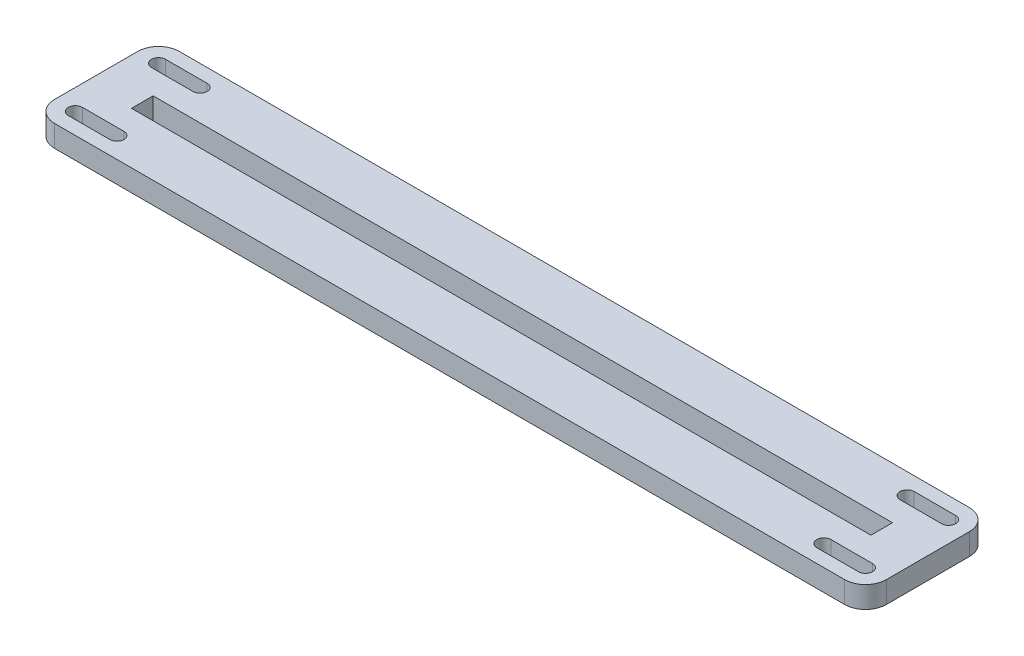
ISO-10303-21;
HEADER;
FILE_DESCRIPTION(('STEP AP214'),'2;1');
FILE_NAME('part.step','',(''),(''),'','','');
FILE_SCHEMA(('AUTOMOTIVE_DESIGN { 1 0 10303 214 1 1 1 1 }'));
ENDSEC;
DATA;
#1=APPLICATION_CONTEXT('core data for automotive mechanical design processes');
#2=APPLICATION_PROTOCOL_DEFINITION('international standard','automotive_design',2000,#1);
#3=PRODUCT_CONTEXT('',#1,'mechanical');
#4=PRODUCT('Part','Part','',(#3));
#5=PRODUCT_RELATED_PRODUCT_CATEGORY('part','',(#4));
#6=PRODUCT_DEFINITION_FORMATION('','',#4);
#7=PRODUCT_DEFINITION_CONTEXT('part definition',#1,'design');
#8=PRODUCT_DEFINITION('design','',#6,#7);
#9=PRODUCT_DEFINITION_SHAPE('','',#8);
#10=(LENGTH_UNIT() NAMED_UNIT(*) SI_UNIT(.MILLI.,.METRE.));
#11=(NAMED_UNIT(*) PLANE_ANGLE_UNIT() SI_UNIT($,.RADIAN.));
#12=(NAMED_UNIT(*) SI_UNIT($,.STERADIAN.) SOLID_ANGLE_UNIT());
#13=UNCERTAINTY_MEASURE_WITH_UNIT(LENGTH_MEASURE(1.E-05),#10,'distance_accuracy_value','');
#14=(GEOMETRIC_REPRESENTATION_CONTEXT(3) GLOBAL_UNCERTAINTY_ASSIGNED_CONTEXT((#13)) GLOBAL_UNIT_ASSIGNED_CONTEXT((#10,
#11,#12)) REPRESENTATION_CONTEXT('',''));
#15=CARTESIAN_POINT('',(0.,0.,0.));
#16=DIRECTION('',(0.,0.,1.));
#17=DIRECTION('',(1.,0.,0.));
#18=AXIS2_PLACEMENT_3D('',#15,#16,#17);
#19=CARTESIAN_POINT('',(0.,6.604,0.));
#20=DIRECTION('',(0.,1.,0.));
#21=DIRECTION('',(0.,0.,1.));
#22=AXIS2_PLACEMENT_3D('',#19,#20,#21);
#23=PLANE('',#22);
#24=DIRECTION('',(1.,0.,0.));
#25=VECTOR('',#24,1.);
#26=CARTESIAN_POINT('',(120.65,6.604,-14.859));
#27=LINE('',#26,#25);
#28=CARTESIAN_POINT('',(107.95,6.604,-14.859));
#29=VERTEX_POINT('',#28);
#30=CARTESIAN_POINT('',(120.65,6.604,-14.859));
#31=VERTEX_POINT('',#30);
#32=EDGE_CURVE('E274',#29,#31,#27,.T.);
#33=ORIENTED_EDGE('',*,*,#32,.T.);
#34=CARTESIAN_POINT('',(120.65,6.604,-12.7));
#35=DIRECTION('',(0.,-1.,0.));
#36=DIRECTION('',(0.,0.,1.));
#37=AXIS2_PLACEMENT_3D('',#34,#35,#36);
#38=CIRCLE('',#37,2.159);
#39=CARTESIAN_POINT('',(120.65,6.604,-10.541));
#40=VERTEX_POINT('',#39);
#41=EDGE_CURVE('E257',#31,#40,#38,.T.);
#42=ORIENTED_EDGE('',*,*,#41,.T.);
#43=DIRECTION('',(-1.,0.,0.));
#44=VECTOR('',#43,1.);
#45=CARTESIAN_POINT('',(120.65,6.604,-10.541));
#46=LINE('',#45,#44);
#47=CARTESIAN_POINT('',(107.95,6.604,-10.541));
#48=VERTEX_POINT('',#47);
#49=EDGE_CURVE('E264',#40,#48,#46,.T.);
#50=ORIENTED_EDGE('',*,*,#49,.T.);
#51=CARTESIAN_POINT('',(107.95,6.604,-12.7));
#52=DIRECTION('',(0.,-1.,0.));
#53=DIRECTION('',(0.,0.,1.));
#54=AXIS2_PLACEMENT_3D('',#51,#52,#53);
#55=CIRCLE('',#54,2.159);
#56=EDGE_CURVE('E277',#48,#29,#55,.T.);
#57=ORIENTED_EDGE('',*,*,#56,.T.);
#58=EDGE_LOOP('',(#33,#42,#50,#57));
#59=FACE_BOUND('',#58,.T.);
#60=CARTESIAN_POINT('',(-120.65,6.604,12.7));
#61=DIRECTION('',(0.,1.,0.));
#62=DIRECTION('',(0.,0.,1.));
#63=AXIS2_PLACEMENT_3D('',#60,#61,#62);
#64=CIRCLE('',#63,2.159);
#65=CARTESIAN_POINT('',(-120.65,6.604,10.541));
#66=VERTEX_POINT('',#65);
#67=CARTESIAN_POINT('',(-120.65,6.604,14.859));
#68=VERTEX_POINT('',#67);
#69=EDGE_CURVE('E285',#66,#68,#64,.T.);
#70=ORIENTED_EDGE('',*,*,#69,.F.);
#71=DIRECTION('',(-1.,0.,0.));
#72=VECTOR('',#71,1.);
#73=CARTESIAN_POINT('',(-120.65,6.604,10.541));
#74=LINE('',#73,#72);
#75=CARTESIAN_POINT('',(-107.95,6.604,10.541));
#76=VERTEX_POINT('',#75);
#77=EDGE_CURVE('E296',#76,#66,#74,.T.);
#78=ORIENTED_EDGE('',*,*,#77,.F.);
#79=CARTESIAN_POINT('',(-107.95,6.604,12.7));
#80=DIRECTION('',(0.,1.,0.));
#81=DIRECTION('',(0.,0.,1.));
#82=AXIS2_PLACEMENT_3D('',#79,#80,#81);
#83=CIRCLE('',#82,2.159);
#84=CARTESIAN_POINT('',(-107.95,6.604,14.859));
#85=VERTEX_POINT('',#84);
#86=EDGE_CURVE('E310',#85,#76,#83,.T.);
#87=ORIENTED_EDGE('',*,*,#86,.F.);
#88=DIRECTION('',(1.,0.,0.));
#89=VECTOR('',#88,1.);
#90=CARTESIAN_POINT('',(-120.65,6.604,14.859));
#91=LINE('',#90,#89);
#92=EDGE_CURVE('E307',#68,#85,#91,.T.);
#93=ORIENTED_EDGE('',*,*,#92,.F.);
#94=EDGE_LOOP('',(#70,#78,#87,#93));
#95=FACE_BOUND('',#94,.T.);
#96=CARTESIAN_POINT('',(-120.65,6.604,-12.7));
#97=DIRECTION('',(0.,1.,0.));
#98=DIRECTION('',(0.,0.,1.));
#99=AXIS2_PLACEMENT_3D('',#96,#97,#98);
#100=CIRCLE('',#99,2.159);
#101=CARTESIAN_POINT('',(-120.65,6.604,-14.859));
#102=VERTEX_POINT('',#101);
#103=CARTESIAN_POINT('',(-120.65,6.604,-10.541));
#104=VERTEX_POINT('',#103);
#105=EDGE_CURVE('E317',#102,#104,#100,.T.);
#106=ORIENTED_EDGE('',*,*,#105,.F.);
#107=DIRECTION('',(-1.,0.,0.));
#108=VECTOR('',#107,1.);
#109=CARTESIAN_POINT('',(-120.65,6.604,-14.859));
#110=LINE('',#109,#108);
#111=CARTESIAN_POINT('',(-107.95,6.604,-14.859));
#112=VERTEX_POINT('',#111);
#113=EDGE_CURVE('E328',#112,#102,#110,.T.);
#114=ORIENTED_EDGE('',*,*,#113,.F.);
#115=CARTESIAN_POINT('',(-107.95,6.604,-12.7));
#116=DIRECTION('',(0.,1.,0.));
#117=DIRECTION('',(0.,0.,1.));
#118=AXIS2_PLACEMENT_3D('',#115,#116,#117);
#119=CIRCLE('',#118,2.159);
#120=CARTESIAN_POINT('',(-107.95,6.604,-10.541));
#121=VERTEX_POINT('',#120);
#122=EDGE_CURVE('E342',#121,#112,#119,.T.);
#123=ORIENTED_EDGE('',*,*,#122,.F.);
#124=DIRECTION('',(1.,0.,0.));
#125=VECTOR('',#124,1.);
#126=CARTESIAN_POINT('',(-120.65,6.604,-10.541));
#127=LINE('',#126,#125);
#128=EDGE_CURVE('E339',#104,#121,#127,.T.);
#129=ORIENTED_EDGE('',*,*,#128,.F.);
#130=EDGE_LOOP('',(#106,#114,#123,#129));
#131=FACE_BOUND('',#130,.T.);
#132=DIRECTION('',(0.,0.,1.));
#133=VECTOR('',#132,1.);
#134=CARTESIAN_POINT('',(-127.,6.604,-19.05));
#135=LINE('',#134,#133);
#136=CARTESIAN_POINT('',(-127.,6.604,-12.7));
#137=VERTEX_POINT('',#136);
#138=CARTESIAN_POINT('',(-127.,6.604,12.7));
#139=VERTEX_POINT('',#138);
#140=EDGE_CURVE('E387',#137,#139,#135,.T.);
#141=ORIENTED_EDGE('',*,*,#140,.T.);
#142=CARTESIAN_POINT('',(-120.65,6.604,12.7));
#143=DIRECTION('',(0.,1.,0.));
#144=DIRECTION('',(0.,0.,1.));
#145=AXIS2_PLACEMENT_3D('',#142,#143,#144);
#146=CIRCLE('',#145,6.35);
#147=CARTESIAN_POINT('',(-120.65,6.604,19.05));
#148=VERTEX_POINT('',#147);
#149=EDGE_CURVE('E430',#139,#148,#146,.T.);
#150=ORIENTED_EDGE('',*,*,#149,.T.);
#151=DIRECTION('',(1.,0.,0.));
#152=VECTOR('',#151,1.);
#153=CARTESIAN_POINT('',(-127.,6.604,19.05));
#154=LINE('',#153,#152);
#155=CARTESIAN_POINT('',(120.65,6.604,19.05));
#156=VERTEX_POINT('',#155);
#157=EDGE_CURVE('E390',#148,#156,#154,.T.);
#158=ORIENTED_EDGE('',*,*,#157,.T.);
#159=CARTESIAN_POINT('',(120.65,6.604,12.7));
#160=DIRECTION('',(0.,1.,0.));
#161=DIRECTION('',(0.,0.,1.));
#162=AXIS2_PLACEMENT_3D('',#159,#160,#161);
#163=CIRCLE('',#162,6.35);
#164=CARTESIAN_POINT('',(127.,6.604,12.7));
#165=VERTEX_POINT('',#164);
#166=EDGE_CURVE('E428',#156,#165,#163,.T.);
#167=ORIENTED_EDGE('',*,*,#166,.T.);
#168=DIRECTION('',(0.,0.,-1.));
#169=VECTOR('',#168,1.);
#170=CARTESIAN_POINT('',(127.,6.604,-19.05));
#171=LINE('',#170,#169);
#172=CARTESIAN_POINT('',(127.,6.604,-12.7));
#173=VERTEX_POINT('',#172);
#174=EDGE_CURVE('E394',#165,#173,#171,.T.);
#175=ORIENTED_EDGE('',*,*,#174,.T.);
#176=CARTESIAN_POINT('',(120.65,6.604,-12.7));
#177=DIRECTION('',(0.,1.,0.));
#178=DIRECTION('',(0.,0.,1.));
#179=AXIS2_PLACEMENT_3D('',#176,#177,#178);
#180=CIRCLE('',#179,6.35);
#181=CARTESIAN_POINT('',(120.65,6.604,-19.05));
#182=VERTEX_POINT('',#181);
#183=EDGE_CURVE('E53',#173,#182,#180,.T.);
#184=ORIENTED_EDGE('',*,*,#183,.T.);
#185=DIRECTION('',(-1.,0.,0.));
#186=VECTOR('',#185,1.);
#187=CARTESIAN_POINT('',(-127.,6.604,-19.05));
#188=LINE('',#187,#186);
#189=CARTESIAN_POINT('',(-120.65,6.604,-19.05));
#190=VERTEX_POINT('',#189);
#191=EDGE_CURVE('E396',#182,#190,#188,.T.);
#192=ORIENTED_EDGE('',*,*,#191,.T.);
#193=CARTESIAN_POINT('',(-120.65,6.604,-12.7));
#194=DIRECTION('',(0.,1.,0.));
#195=DIRECTION('',(0.,0.,1.));
#196=AXIS2_PLACEMENT_3D('',#193,#194,#195);
#197=CIRCLE('',#196,6.35);
#198=EDGE_CURVE('E426',#190,#137,#197,.T.);
#199=ORIENTED_EDGE('',*,*,#198,.T.);
#200=EDGE_LOOP('',(#141,#150,#158,#167,#175,#184,#192,#199));
#201=FACE_BOUND('',#200,.T.);
#202=DIRECTION('',(1.,0.,0.));
#203=VECTOR('',#202,1.);
#204=CARTESIAN_POINT('',(-112.903,6.604,3.30200000000001));
#205=LINE('',#204,#203);
#206=CARTESIAN_POINT('',(-112.903,6.604,3.30200000000001));
#207=VERTEX_POINT('',#206);
#208=CARTESIAN_POINT('',(112.903,6.604,3.30200000000001));
#209=VERTEX_POINT('',#208);
#210=EDGE_CURVE('E358',#207,#209,#205,.T.);
#211=ORIENTED_EDGE('',*,*,#210,.F.);
#212=DIRECTION('',(0.,0.,1.));
#213=VECTOR('',#212,1.);
#214=CARTESIAN_POINT('',(-112.903,6.604,-3.30199999999999));
#215=LINE('',#214,#213);
#216=CARTESIAN_POINT('',(-112.903,6.604,-3.30199999999999));
#217=VERTEX_POINT('',#216);
#218=EDGE_CURVE('E356',#217,#207,#215,.T.);
#219=ORIENTED_EDGE('',*,*,#218,.F.);
#220=DIRECTION('',(-1.,0.,0.));
#221=VECTOR('',#220,1.);
#222=CARTESIAN_POINT('',(-112.903,6.604,-3.30199999999999));
#223=LINE('',#222,#221);
#224=CARTESIAN_POINT('',(112.903,6.604,-3.30199999999999));
#225=VERTEX_POINT('',#224);
#226=EDGE_CURVE('E364',#225,#217,#223,.T.);
#227=ORIENTED_EDGE('',*,*,#226,.F.);
#228=DIRECTION('',(0.,0.,-1.));
#229=VECTOR('',#228,1.);
#230=CARTESIAN_POINT('',(112.903,6.604,-3.30199999999999));
#231=LINE('',#230,#229);
#232=EDGE_CURVE('E361',#209,#225,#231,.T.);
#233=ORIENTED_EDGE('',*,*,#232,.F.);
#234=EDGE_LOOP('',(#211,#219,#227,#233));
#235=FACE_BOUND('',#234,.T.);
#236=DIRECTION('',(1.,0.,0.));
#237=VECTOR('',#236,1.);
#238=CARTESIAN_POINT('',(120.65,6.604,10.541));
#239=LINE('',#238,#237);
#240=CARTESIAN_POINT('',(107.95,6.604,10.541));
#241=VERTEX_POINT('',#240);
#242=CARTESIAN_POINT('',(120.65,6.604,10.541));
#243=VERTEX_POINT('',#242);
#244=EDGE_CURVE('E251',#241,#243,#239,.T.);
#245=ORIENTED_EDGE('',*,*,#244,.T.);
#246=CARTESIAN_POINT('',(120.65,6.604,12.7));
#247=DIRECTION('',(0.,-1.,0.));
#248=DIRECTION('',(0.,0.,1.));
#249=AXIS2_PLACEMENT_3D('',#246,#247,#248);
#250=CIRCLE('',#249,2.159);
#251=CARTESIAN_POINT('',(120.65,6.604,14.859));
#252=VERTEX_POINT('',#251);
#253=EDGE_CURVE('E237',#243,#252,#250,.T.);
#254=ORIENTED_EDGE('',*,*,#253,.T.);
#255=DIRECTION('',(-1.,0.,0.));
#256=VECTOR('',#255,1.);
#257=CARTESIAN_POINT('',(120.65,6.604,14.859));
#258=LINE('',#257,#256);
#259=CARTESIAN_POINT('',(107.95,6.604,14.859));
#260=VERTEX_POINT('',#259);
#261=EDGE_CURVE('E242',#252,#260,#258,.T.);
#262=ORIENTED_EDGE('',*,*,#261,.T.);
#263=CARTESIAN_POINT('',(107.95,6.604,12.7));
#264=DIRECTION('',(0.,-1.,0.));
#265=DIRECTION('',(0.,0.,1.));
#266=AXIS2_PLACEMENT_3D('',#263,#264,#265);
#267=CIRCLE('',#266,2.159);
#268=EDGE_CURVE('E245',#260,#241,#267,.T.);
#269=ORIENTED_EDGE('',*,*,#268,.T.);
#270=EDGE_LOOP('',(#245,#254,#262,#269));
#271=FACE_BOUND('',#270,.T.);
#272=ADVANCED_FACE('F33',(#59,#95,#131,#201,#235,#271),#23,.T.);
#273=CARTESIAN_POINT('',(0.,0.,0.));
#274=DIRECTION('',(0.,1.,0.));
#275=DIRECTION('',(0.,0.,1.));
#276=AXIS2_PLACEMENT_3D('',#273,#274,#275);
#277=PLANE('',#276);
#278=CARTESIAN_POINT('',(120.65,0.,-12.7));
#279=DIRECTION('',(0.,-1.,0.));
#280=DIRECTION('',(0.,0.,1.));
#281=AXIS2_PLACEMENT_3D('',#278,#279,#280);
#282=CIRCLE('',#281,2.159);
#283=CARTESIAN_POINT('',(120.65,0.,-14.859));
#284=VERTEX_POINT('',#283);
#285=CARTESIAN_POINT('',(120.65,0.,-10.541));
#286=VERTEX_POINT('',#285);
#287=EDGE_CURVE('E261',#284,#286,#282,.T.);
#288=ORIENTED_EDGE('',*,*,#287,.F.);
#289=DIRECTION('',(1.,0.,0.));
#290=VECTOR('',#289,1.);
#291=CARTESIAN_POINT('',(120.65,0.,-14.859));
#292=LINE('',#291,#290);
#293=CARTESIAN_POINT('',(107.95,0.,-14.859));
#294=VERTEX_POINT('',#293);
#295=EDGE_CURVE('E263',#294,#284,#292,.T.);
#296=ORIENTED_EDGE('',*,*,#295,.F.);
#297=CARTESIAN_POINT('',(107.95,0.,-12.7));
#298=DIRECTION('',(0.,-1.,0.));
#299=DIRECTION('',(0.,0.,1.));
#300=AXIS2_PLACEMENT_3D('',#297,#298,#299);
#301=CIRCLE('',#300,2.159);
#302=CARTESIAN_POINT('',(107.95,0.,-10.541));
#303=VERTEX_POINT('',#302);
#304=EDGE_CURVE('E266',#303,#294,#301,.T.);
#305=ORIENTED_EDGE('',*,*,#304,.F.);
#306=DIRECTION('',(-1.,0.,0.));
#307=VECTOR('',#306,1.);
#308=CARTESIAN_POINT('',(120.65,0.,-10.541));
#309=LINE('',#308,#307);
#310=EDGE_CURVE('E269',#286,#303,#309,.T.);
#311=ORIENTED_EDGE('',*,*,#310,.F.);
#312=EDGE_LOOP('',(#288,#296,#305,#311));
#313=FACE_BOUND('',#312,.T.);
#314=DIRECTION('',(-1.,0.,0.));
#315=VECTOR('',#314,1.);
#316=CARTESIAN_POINT('',(-120.65,0.,10.541));
#317=LINE('',#316,#315);
#318=CARTESIAN_POINT('',(-107.95,0.,10.541));
#319=VERTEX_POINT('',#318);
#320=CARTESIAN_POINT('',(-120.65,0.,10.541));
#321=VERTEX_POINT('',#320);
#322=EDGE_CURVE('E302',#319,#321,#317,.T.);
#323=ORIENTED_EDGE('',*,*,#322,.T.);
#324=CARTESIAN_POINT('',(-120.65,0.,12.7));
#325=DIRECTION('',(0.,1.,0.));
#326=DIRECTION('',(0.,0.,1.));
#327=AXIS2_PLACEMENT_3D('',#324,#325,#326);
#328=CIRCLE('',#327,2.159);
#329=CARTESIAN_POINT('',(-120.65,0.,14.859));
#330=VERTEX_POINT('',#329);
#331=EDGE_CURVE('E292',#321,#330,#328,.T.);
#332=ORIENTED_EDGE('',*,*,#331,.T.);
#333=DIRECTION('',(1.,0.,0.));
#334=VECTOR('',#333,1.);
#335=CARTESIAN_POINT('',(-120.65,0.,14.859));
#336=LINE('',#335,#334);
#337=CARTESIAN_POINT('',(-107.95,0.,14.859));
#338=VERTEX_POINT('',#337);
#339=EDGE_CURVE('E295',#330,#338,#336,.T.);
#340=ORIENTED_EDGE('',*,*,#339,.T.);
#341=CARTESIAN_POINT('',(-107.95,0.,12.7));
#342=DIRECTION('',(0.,1.,0.));
#343=DIRECTION('',(0.,0.,1.));
#344=AXIS2_PLACEMENT_3D('',#341,#342,#343);
#345=CIRCLE('',#344,2.159);
#346=EDGE_CURVE('E299',#338,#319,#345,.T.);
#347=ORIENTED_EDGE('',*,*,#346,.T.);
#348=EDGE_LOOP('',(#323,#332,#340,#347));
#349=FACE_BOUND('',#348,.T.);
#350=DIRECTION('',(-1.,0.,0.));
#351=VECTOR('',#350,1.);
#352=CARTESIAN_POINT('',(-120.65,0.,-14.859));
#353=LINE('',#352,#351);
#354=CARTESIAN_POINT('',(-107.95,0.,-14.859));
#355=VERTEX_POINT('',#354);
#356=CARTESIAN_POINT('',(-120.65,0.,-14.859));
#357=VERTEX_POINT('',#356);
#358=EDGE_CURVE('E334',#355,#357,#353,.T.);
#359=ORIENTED_EDGE('',*,*,#358,.T.);
#360=CARTESIAN_POINT('',(-120.65,0.,-12.7));
#361=DIRECTION('',(0.,1.,0.));
#362=DIRECTION('',(0.,0.,1.));
#363=AXIS2_PLACEMENT_3D('',#360,#361,#362);
#364=CIRCLE('',#363,2.159);
#365=CARTESIAN_POINT('',(-120.65,0.,-10.541));
#366=VERTEX_POINT('',#365);
#367=EDGE_CURVE('E324',#357,#366,#364,.T.);
#368=ORIENTED_EDGE('',*,*,#367,.T.);
#369=DIRECTION('',(1.,0.,0.));
#370=VECTOR('',#369,1.);
#371=CARTESIAN_POINT('',(-120.65,0.,-10.541));
#372=LINE('',#371,#370);
#373=CARTESIAN_POINT('',(-107.95,0.,-10.541));
#374=VERTEX_POINT('',#373);
#375=EDGE_CURVE('E327',#366,#374,#372,.T.);
#376=ORIENTED_EDGE('',*,*,#375,.T.);
#377=CARTESIAN_POINT('',(-107.95,0.,-12.7));
#378=DIRECTION('',(0.,1.,0.));
#379=DIRECTION('',(0.,0.,1.));
#380=AXIS2_PLACEMENT_3D('',#377,#378,#379);
#381=CIRCLE('',#380,2.159);
#382=EDGE_CURVE('E331',#374,#355,#381,.T.);
#383=ORIENTED_EDGE('',*,*,#382,.T.);
#384=EDGE_LOOP('',(#359,#368,#376,#383));
#385=FACE_BOUND('',#384,.T.);
#386=DIRECTION('',(1.,0.,0.));
#387=VECTOR('',#386,1.);
#388=CARTESIAN_POINT('',(-127.,0.,19.05));
#389=LINE('',#388,#387);
#390=CARTESIAN_POINT('',(-120.65,0.,19.05));
#391=VERTEX_POINT('',#390);
#392=CARTESIAN_POINT('',(120.65,0.,19.05));
#393=VERTEX_POINT('',#392);
#394=EDGE_CURVE('E401',#391,#393,#389,.T.);
#395=ORIENTED_EDGE('',*,*,#394,.F.);
#396=CARTESIAN_POINT('',(-120.65,0.,12.7));
#397=DIRECTION('',(0.,1.,0.));
#398=DIRECTION('',(0.,0.,1.));
#399=AXIS2_PLACEMENT_3D('',#396,#397,#398);
#400=CIRCLE('',#399,6.35);
#401=CARTESIAN_POINT('',(-127.,0.,12.7));
#402=VERTEX_POINT('',#401);
#403=EDGE_CURVE('E418',#391,#402,#400,.F.);
#404=ORIENTED_EDGE('',*,*,#403,.T.);
#405=DIRECTION('',(0.,0.,1.));
#406=VECTOR('',#405,1.);
#407=CARTESIAN_POINT('',(-127.,0.,-19.05));
#408=LINE('',#407,#406);
#409=CARTESIAN_POINT('',(-127.,0.,-12.7));
#410=VERTEX_POINT('',#409);
#411=EDGE_CURVE('E386',#410,#402,#408,.T.);
#412=ORIENTED_EDGE('',*,*,#411,.F.);
#413=CARTESIAN_POINT('',(-120.65,0.,-12.7));
#414=DIRECTION('',(0.,1.,0.));
#415=DIRECTION('',(0.,0.,1.));
#416=AXIS2_PLACEMENT_3D('',#413,#414,#415);
#417=CIRCLE('',#416,6.35);
#418=CARTESIAN_POINT('',(-120.65,0.,-19.05));
#419=VERTEX_POINT('',#418);
#420=EDGE_CURVE('E414',#410,#419,#417,.F.);
#421=ORIENTED_EDGE('',*,*,#420,.T.);
#422=DIRECTION('',(-1.,0.,0.));
#423=VECTOR('',#422,1.);
#424=CARTESIAN_POINT('',(-127.,0.,-19.05));
#425=LINE('',#424,#423);
#426=CARTESIAN_POINT('',(120.65,0.,-19.05));
#427=VERTEX_POINT('',#426);
#428=EDGE_CURVE('E391',#427,#419,#425,.T.);
#429=ORIENTED_EDGE('',*,*,#428,.F.);
#430=CARTESIAN_POINT('',(120.65,0.,-12.7));
#431=DIRECTION('',(0.,1.,0.));
#432=DIRECTION('',(0.,0.,1.));
#433=AXIS2_PLACEMENT_3D('',#430,#431,#432);
#434=CIRCLE('',#433,6.35);
#435=CARTESIAN_POINT('',(127.,0.,-12.7));
#436=VERTEX_POINT('',#435);
#437=EDGE_CURVE('E412',#427,#436,#434,.F.);
#438=ORIENTED_EDGE('',*,*,#437,.T.);
#439=DIRECTION('',(0.,0.,-1.));
#440=VECTOR('',#439,1.);
#441=CARTESIAN_POINT('',(127.,0.,-19.05));
#442=LINE('',#441,#440);
#443=CARTESIAN_POINT('',(127.,0.,12.7));
#444=VERTEX_POINT('',#443);
#445=EDGE_CURVE('E404',#444,#436,#442,.T.);
#446=ORIENTED_EDGE('',*,*,#445,.F.);
#447=CARTESIAN_POINT('',(120.65,0.,12.7));
#448=DIRECTION('',(0.,1.,0.));
#449=DIRECTION('',(0.,0.,1.));
#450=AXIS2_PLACEMENT_3D('',#447,#448,#449);
#451=CIRCLE('',#450,6.35);
#452=EDGE_CURVE('E416',#444,#393,#451,.F.);
#453=ORIENTED_EDGE('',*,*,#452,.T.);
#454=EDGE_LOOP('',(#395,#404,#412,#421,#429,#438,#446,#453));
#455=FACE_BOUND('',#454,.T.);
#456=DIRECTION('',(0.,0.,1.));
#457=VECTOR('',#456,1.);
#458=CARTESIAN_POINT('',(-112.903,0.,-3.30199999999999));
#459=LINE('',#458,#457);
#460=CARTESIAN_POINT('',(-112.903,0.,-3.30199999999999));
#461=VERTEX_POINT('',#460);
#462=CARTESIAN_POINT('',(-112.903,0.,3.30200000000001));
#463=VERTEX_POINT('',#462);
#464=EDGE_CURVE('E349',#461,#463,#459,.T.);
#465=ORIENTED_EDGE('',*,*,#464,.T.);
#466=DIRECTION('',(1.,0.,0.));
#467=VECTOR('',#466,1.);
#468=CARTESIAN_POINT('',(-112.903,0.,3.30200000000001));
#469=LINE('',#468,#467);
#470=CARTESIAN_POINT('',(112.903,0.,3.30200000000001));
#471=VERTEX_POINT('',#470);
#472=EDGE_CURVE('E369',#463,#471,#469,.T.);
#473=ORIENTED_EDGE('',*,*,#472,.T.);
#474=DIRECTION('',(0.,0.,-1.));
#475=VECTOR('',#474,1.);
#476=CARTESIAN_POINT('',(112.903,0.,-3.30199999999999));
#477=LINE('',#476,#475);
#478=CARTESIAN_POINT('',(112.903,0.,-3.30199999999999));
#479=VERTEX_POINT('',#478);
#480=EDGE_CURVE('E372',#471,#479,#477,.T.);
#481=ORIENTED_EDGE('',*,*,#480,.T.);
#482=DIRECTION('',(-1.,0.,0.));
#483=VECTOR('',#482,1.);
#484=CARTESIAN_POINT('',(-112.903,0.,-3.30199999999999));
#485=LINE('',#484,#483);
#486=EDGE_CURVE('E359',#479,#461,#485,.T.);
#487=ORIENTED_EDGE('',*,*,#486,.T.);
#488=EDGE_LOOP('',(#465,#473,#481,#487));
#489=FACE_BOUND('',#488,.T.);
#490=CARTESIAN_POINT('',(120.65,0.,12.7));
#491=DIRECTION('',(0.,-1.,0.));
#492=DIRECTION('',(0.,0.,1.));
#493=AXIS2_PLACEMENT_3D('',#490,#491,#492);
#494=CIRCLE('',#493,2.159);
#495=CARTESIAN_POINT('',(120.65,0.,10.541));
#496=VERTEX_POINT('',#495);
#497=CARTESIAN_POINT('',(120.65,0.,14.859));
#498=VERTEX_POINT('',#497);
#499=EDGE_CURVE('E230',#496,#498,#494,.T.);
#500=ORIENTED_EDGE('',*,*,#499,.F.);
#501=DIRECTION('',(1.,0.,0.));
#502=VECTOR('',#501,1.);
#503=CARTESIAN_POINT('',(120.65,0.,10.541));
#504=LINE('',#503,#502);
#505=CARTESIAN_POINT('',(107.95,0.,10.541));
#506=VERTEX_POINT('',#505);
#507=EDGE_CURVE('E218',#506,#496,#504,.T.);
#508=ORIENTED_EDGE('',*,*,#507,.F.);
#509=CARTESIAN_POINT('',(107.95,0.,12.7));
#510=DIRECTION('',(0.,-1.,0.));
#511=DIRECTION('',(0.,0.,1.));
#512=AXIS2_PLACEMENT_3D('',#509,#510,#511);
#513=CIRCLE('',#512,2.159);
#514=CARTESIAN_POINT('',(107.95,0.,14.859));
#515=VERTEX_POINT('',#514);
#516=EDGE_CURVE('E229',#515,#506,#513,.T.);
#517=ORIENTED_EDGE('',*,*,#516,.F.);
#518=DIRECTION('',(-1.,0.,0.));
#519=VECTOR('',#518,1.);
#520=CARTESIAN_POINT('',(120.65,0.,14.859));
#521=LINE('',#520,#519);
#522=EDGE_CURVE('E238',#498,#515,#521,.T.);
#523=ORIENTED_EDGE('',*,*,#522,.F.);
#524=EDGE_LOOP('',(#500,#508,#517,#523));
#525=FACE_BOUND('',#524,.T.);
#526=ADVANCED_FACE('F241',(#313,#349,#385,#455,#489,#525),#277,.F.);
#527=CARTESIAN_POINT('',(-127.,6.604,-19.05));
#528=DIRECTION('',(1.,0.,0.));
#529=DIRECTION('',(0.,0.,-1.));
#530=AXIS2_PLACEMENT_3D('',#527,#528,#529);
#531=PLANE('',#530);
#532=ORIENTED_EDGE('',*,*,#411,.T.);
#533=DIRECTION('',(0.,-1.,0.));
#534=VECTOR('',#533,1.);
#535=CARTESIAN_POINT('',(-127.,6.604,12.7));
#536=LINE('',#535,#534);
#537=EDGE_CURVE('E423',#402,#139,#536,.F.);
#538=ORIENTED_EDGE('',*,*,#537,.T.);
#539=ORIENTED_EDGE('',*,*,#140,.F.);
#540=DIRECTION('',(0.,-1.,0.));
#541=VECTOR('',#540,1.);
#542=CARTESIAN_POINT('',(-127.,6.604,-12.7));
#543=LINE('',#542,#541);
#544=EDGE_CURVE('E420',#137,#410,#543,.T.);
#545=ORIENTED_EDGE('',*,*,#544,.T.);
#546=EDGE_LOOP('',(#532,#538,#539,#545));
#547=FACE_BOUND('',#546,.T.);
#548=ADVANCED_FACE('F452',(#547),#531,.F.);
#549=CARTESIAN_POINT('',(-127.,6.604,19.05));
#550=DIRECTION('',(0.,0.,-1.));
#551=DIRECTION('',(-1.,0.,0.));
#552=AXIS2_PLACEMENT_3D('',#549,#550,#551);
#553=PLANE('',#552);
#554=ORIENTED_EDGE('',*,*,#157,.F.);
#555=DIRECTION('',(0.,-1.,0.));
#556=VECTOR('',#555,1.);
#557=CARTESIAN_POINT('',(-120.65,6.604,19.05));
#558=LINE('',#557,#556);
#559=EDGE_CURVE('E409',#148,#391,#558,.T.);
#560=ORIENTED_EDGE('',*,*,#559,.T.);
#561=ORIENTED_EDGE('',*,*,#394,.T.);
#562=DIRECTION('',(0.,-1.,0.));
#563=VECTOR('',#562,1.);
#564=CARTESIAN_POINT('',(120.65,6.604,19.05));
#565=LINE('',#564,#563);
#566=EDGE_CURVE('E398',#393,#156,#565,.F.);
#567=ORIENTED_EDGE('',*,*,#566,.T.);
#568=EDGE_LOOP('',(#554,#560,#561,#567));
#569=FACE_BOUND('',#568,.T.);
#570=ADVANCED_FACE('F461',(#569),#553,.F.);
#571=CARTESIAN_POINT('',(127.,6.604,-19.05));
#572=DIRECTION('',(-1.,0.,0.));
#573=DIRECTION('',(0.,0.,1.));
#574=AXIS2_PLACEMENT_3D('',#571,#572,#573);
#575=PLANE('',#574);
#576=ORIENTED_EDGE('',*,*,#174,.F.);
#577=DIRECTION('',(0.,-1.,0.));
#578=VECTOR('',#577,1.);
#579=CARTESIAN_POINT('',(127.,6.604,12.7));
#580=LINE('',#579,#578);
#581=EDGE_CURVE('E434',#165,#444,#580,.T.);
#582=ORIENTED_EDGE('',*,*,#581,.T.);
#583=ORIENTED_EDGE('',*,*,#445,.T.);
#584=DIRECTION('',(0.,-1.,0.));
#585=VECTOR('',#584,1.);
#586=CARTESIAN_POINT('',(127.,6.604,-12.7));
#587=LINE('',#586,#585);
#588=EDGE_CURVE('E432',#436,#173,#587,.F.);
#589=ORIENTED_EDGE('',*,*,#588,.T.);
#590=EDGE_LOOP('',(#576,#582,#583,#589));
#591=FACE_BOUND('',#590,.T.);
#592=ADVANCED_FACE('F469',(#591),#575,.F.);
#593=CARTESIAN_POINT('',(-127.,6.604,-19.05));
#594=DIRECTION('',(0.,0.,1.));
#595=DIRECTION('',(1.,0.,0.));
#596=AXIS2_PLACEMENT_3D('',#593,#594,#595);
#597=PLANE('',#596);
#598=ORIENTED_EDGE('',*,*,#428,.T.);
#599=DIRECTION('',(0.,-1.,0.));
#600=VECTOR('',#599,1.);
#601=CARTESIAN_POINT('',(-120.65,6.604,-19.05));
#602=LINE('',#601,#600);
#603=EDGE_CURVE('E11',#419,#190,#602,.F.);
#604=ORIENTED_EDGE('',*,*,#603,.T.);
#605=ORIENTED_EDGE('',*,*,#191,.F.);
#606=DIRECTION('',(0.,-1.,0.));
#607=VECTOR('',#606,1.);
#608=CARTESIAN_POINT('',(120.65,6.604,-19.05));
#609=LINE('',#608,#607);
#610=EDGE_CURVE('E41',#182,#427,#609,.T.);
#611=ORIENTED_EDGE('',*,*,#610,.T.);
#612=EDGE_LOOP('',(#598,#604,#605,#611));
#613=FACE_BOUND('',#612,.T.);
#614=ADVANCED_FACE('F439',(#613),#597,.F.);
#615=CARTESIAN_POINT('',(-112.903,6.604,-3.30199999999999));
#616=DIRECTION('',(1.,0.,0.));
#617=DIRECTION('',(0.,0.,-1.));
#618=AXIS2_PLACEMENT_3D('',#615,#616,#617);
#619=PLANE('',#618);
#620=ORIENTED_EDGE('',*,*,#464,.F.);
#621=DIRECTION('',(0.,-1.,0.));
#622=VECTOR('',#621,1.);
#623=CARTESIAN_POINT('',(-112.903,6.604,-3.30199999999999));
#624=LINE('',#623,#622);
#625=EDGE_CURVE('E366',#217,#461,#624,.T.);
#626=ORIENTED_EDGE('',*,*,#625,.F.);
#627=ORIENTED_EDGE('',*,*,#218,.T.);
#628=DIRECTION('',(0.,-1.,0.));
#629=VECTOR('',#628,1.);
#630=CARTESIAN_POINT('',(-112.903,6.604,3.30200000000001));
#631=LINE('',#630,#629);
#632=EDGE_CURVE('E383',#207,#463,#631,.T.);
#633=ORIENTED_EDGE('',*,*,#632,.T.);
#634=EDGE_LOOP('',(#620,#626,#627,#633));
#635=FACE_BOUND('',#634,.T.);
#636=ADVANCED_FACE('F485',(#635),#619,.T.);
#637=CARTESIAN_POINT('',(-112.903,6.604,3.30200000000001));
#638=DIRECTION('',(0.,0.,-1.));
#639=DIRECTION('',(-1.,0.,0.));
#640=AXIS2_PLACEMENT_3D('',#637,#638,#639);
#641=PLANE('',#640);
#642=ORIENTED_EDGE('',*,*,#472,.F.);
#643=ORIENTED_EDGE('',*,*,#632,.F.);
#644=ORIENTED_EDGE('',*,*,#210,.T.);
#645=DIRECTION('',(0.,-1.,0.));
#646=VECTOR('',#645,1.);
#647=CARTESIAN_POINT('',(112.903,6.604,3.30200000000001));
#648=LINE('',#647,#646);
#649=EDGE_CURVE('E381',#209,#471,#648,.T.);
#650=ORIENTED_EDGE('',*,*,#649,.T.);
#651=EDGE_LOOP('',(#642,#643,#644,#650));
#652=FACE_BOUND('',#651,.T.);
#653=ADVANCED_FACE('F688',(#652),#641,.T.);
#654=CARTESIAN_POINT('',(112.903,6.604,-3.30199999999999));
#655=DIRECTION('',(-1.,0.,0.));
#656=DIRECTION('',(0.,0.,1.));
#657=AXIS2_PLACEMENT_3D('',#654,#655,#656);
#658=PLANE('',#657);
#659=ORIENTED_EDGE('',*,*,#480,.F.);
#660=ORIENTED_EDGE('',*,*,#649,.F.);
#661=ORIENTED_EDGE('',*,*,#232,.T.);
#662=DIRECTION('',(0.,-1.,0.));
#663=VECTOR('',#662,1.);
#664=CARTESIAN_POINT('',(112.903,6.604,-3.30199999999999));
#665=LINE('',#664,#663);
#666=EDGE_CURVE('E379',#225,#479,#665,.T.);
#667=ORIENTED_EDGE('',*,*,#666,.T.);
#668=EDGE_LOOP('',(#659,#660,#661,#667));
#669=FACE_BOUND('',#668,.T.);
#670=ADVANCED_FACE('F679',(#669),#658,.T.);
#671=CARTESIAN_POINT('',(-112.903,6.604,-3.30199999999999));
#672=DIRECTION('',(0.,0.,1.));
#673=DIRECTION('',(1.,0.,0.));
#674=AXIS2_PLACEMENT_3D('',#671,#672,#673);
#675=PLANE('',#674);
#676=ORIENTED_EDGE('',*,*,#486,.F.);
#677=ORIENTED_EDGE('',*,*,#666,.F.);
#678=ORIENTED_EDGE('',*,*,#226,.T.);
#679=ORIENTED_EDGE('',*,*,#625,.T.);
#680=EDGE_LOOP('',(#676,#677,#678,#679));
#681=FACE_BOUND('',#680,.T.);
#682=ADVANCED_FACE('F670',(#681),#675,.T.);
#683=CARTESIAN_POINT('',(-120.65,0.,-12.7));
#684=DIRECTION('',(0.,1.,0.));
#685=DIRECTION('',(0.,0.,1.));
#686=AXIS2_PLACEMENT_3D('',#683,#684,#685);
#687=CYLINDRICAL_SURFACE('',#686,2.159);
#688=ORIENTED_EDGE('',*,*,#105,.T.);
#689=DIRECTION('',(0.,1.,0.));
#690=VECTOR('',#689,1.);
#691=CARTESIAN_POINT('',(-120.65,0.,-10.541));
#692=LINE('',#691,#690);
#693=EDGE_CURVE('E337',#366,#104,#692,.T.);
#694=ORIENTED_EDGE('',*,*,#693,.F.);
#695=ORIENTED_EDGE('',*,*,#367,.F.);
#696=DIRECTION('',(0.,1.,0.));
#697=VECTOR('',#696,1.);
#698=CARTESIAN_POINT('',(-120.65,0.,-14.859));
#699=LINE('',#698,#697);
#700=EDGE_CURVE('E347',#357,#102,#699,.T.);
#701=ORIENTED_EDGE('',*,*,#700,.T.);
#702=EDGE_LOOP('',(#688,#694,#695,#701));
#703=FACE_BOUND('',#702,.T.);
#704=ADVANCED_FACE('F661',(#703),#687,.F.);
#705=CARTESIAN_POINT('',(-120.65,0.,-14.859));
#706=DIRECTION('',(0.,0.,-1.));
#707=DIRECTION('',(-1.,0.,0.));
#708=AXIS2_PLACEMENT_3D('',#705,#706,#707);
#709=PLANE('',#708);
#710=ORIENTED_EDGE('',*,*,#113,.T.);
#711=ORIENTED_EDGE('',*,*,#700,.F.);
#712=ORIENTED_EDGE('',*,*,#358,.F.);
#713=DIRECTION('',(0.,1.,0.));
#714=VECTOR('',#713,1.);
#715=CARTESIAN_POINT('',(-107.95,0.,-14.859));
#716=LINE('',#715,#714);
#717=EDGE_CURVE('E350',#355,#112,#716,.T.);
#718=ORIENTED_EDGE('',*,*,#717,.T.);
#719=EDGE_LOOP('',(#710,#711,#712,#718));
#720=FACE_BOUND('',#719,.T.);
#721=ADVANCED_FACE('F652',(#720),#709,.F.);
#722=CARTESIAN_POINT('',(-107.95,0.,-12.7));
#723=DIRECTION('',(0.,1.,0.));
#724=DIRECTION('',(0.,0.,1.));
#725=AXIS2_PLACEMENT_3D('',#722,#723,#724);
#726=CYLINDRICAL_SURFACE('',#725,2.159);
#727=ORIENTED_EDGE('',*,*,#122,.T.);
#728=ORIENTED_EDGE('',*,*,#717,.F.);
#729=ORIENTED_EDGE('',*,*,#382,.F.);
#730=DIRECTION('',(0.,1.,0.));
#731=VECTOR('',#730,1.);
#732=CARTESIAN_POINT('',(-107.95,0.,-10.541));
#733=LINE('',#732,#731);
#734=EDGE_CURVE('E352',#374,#121,#733,.T.);
#735=ORIENTED_EDGE('',*,*,#734,.T.);
#736=EDGE_LOOP('',(#727,#728,#729,#735));
#737=FACE_BOUND('',#736,.T.);
#738=ADVANCED_FACE('F643',(#737),#726,.F.);
#739=CARTESIAN_POINT('',(-120.65,0.,-10.541));
#740=DIRECTION('',(0.,0.,1.));
#741=DIRECTION('',(1.,0.,0.));
#742=AXIS2_PLACEMENT_3D('',#739,#740,#741);
#743=PLANE('',#742);
#744=ORIENTED_EDGE('',*,*,#128,.T.);
#745=ORIENTED_EDGE('',*,*,#734,.F.);
#746=ORIENTED_EDGE('',*,*,#375,.F.);
#747=ORIENTED_EDGE('',*,*,#693,.T.);
#748=EDGE_LOOP('',(#744,#745,#746,#747));
#749=FACE_BOUND('',#748,.T.);
#750=ADVANCED_FACE('F634',(#749),#743,.F.);
#751=CARTESIAN_POINT('',(-120.65,0.,12.7));
#752=DIRECTION('',(0.,1.,0.));
#753=DIRECTION('',(0.,0.,1.));
#754=AXIS2_PLACEMENT_3D('',#751,#752,#753);
#755=CYLINDRICAL_SURFACE('',#754,2.159);
#756=ORIENTED_EDGE('',*,*,#69,.T.);
#757=DIRECTION('',(0.,1.,0.));
#758=VECTOR('',#757,1.);
#759=CARTESIAN_POINT('',(-120.65,0.,14.859));
#760=LINE('',#759,#758);
#761=EDGE_CURVE('E305',#330,#68,#760,.T.);
#762=ORIENTED_EDGE('',*,*,#761,.F.);
#763=ORIENTED_EDGE('',*,*,#331,.F.);
#764=DIRECTION('',(0.,1.,0.));
#765=VECTOR('',#764,1.);
#766=CARTESIAN_POINT('',(-120.65,0.,10.541));
#767=LINE('',#766,#765);
#768=EDGE_CURVE('E315',#321,#66,#767,.T.);
#769=ORIENTED_EDGE('',*,*,#768,.T.);
#770=EDGE_LOOP('',(#756,#762,#763,#769));
#771=FACE_BOUND('',#770,.T.);
#772=ADVANCED_FACE('F625',(#771),#755,.F.);
#773=CARTESIAN_POINT('',(-120.65,0.,10.541));
#774=DIRECTION('',(0.,0.,-1.));
#775=DIRECTION('',(-1.,0.,0.));
#776=AXIS2_PLACEMENT_3D('',#773,#774,#775);
#777=PLANE('',#776);
#778=ORIENTED_EDGE('',*,*,#77,.T.);
#779=ORIENTED_EDGE('',*,*,#768,.F.);
#780=ORIENTED_EDGE('',*,*,#322,.F.);
#781=DIRECTION('',(0.,1.,0.));
#782=VECTOR('',#781,1.);
#783=CARTESIAN_POINT('',(-107.95,0.,10.541));
#784=LINE('',#783,#782);
#785=EDGE_CURVE('E318',#319,#76,#784,.T.);
#786=ORIENTED_EDGE('',*,*,#785,.T.);
#787=EDGE_LOOP('',(#778,#779,#780,#786));
#788=FACE_BOUND('',#787,.T.);
#789=ADVANCED_FACE('F616',(#788),#777,.F.);
#790=CARTESIAN_POINT('',(-107.95,0.,12.7));
#791=DIRECTION('',(0.,1.,0.));
#792=DIRECTION('',(0.,0.,1.));
#793=AXIS2_PLACEMENT_3D('',#790,#791,#792);
#794=CYLINDRICAL_SURFACE('',#793,2.159);
#795=ORIENTED_EDGE('',*,*,#86,.T.);
#796=ORIENTED_EDGE('',*,*,#785,.F.);
#797=ORIENTED_EDGE('',*,*,#346,.F.);
#798=DIRECTION('',(0.,1.,0.));
#799=VECTOR('',#798,1.);
#800=CARTESIAN_POINT('',(-107.95,0.,14.859));
#801=LINE('',#800,#799);
#802=EDGE_CURVE('E320',#338,#85,#801,.T.);
#803=ORIENTED_EDGE('',*,*,#802,.T.);
#804=EDGE_LOOP('',(#795,#796,#797,#803));
#805=FACE_BOUND('',#804,.T.);
#806=ADVANCED_FACE('F607',(#805),#794,.F.);
#807=CARTESIAN_POINT('',(-120.65,0.,14.859));
#808=DIRECTION('',(0.,0.,1.));
#809=DIRECTION('',(1.,0.,0.));
#810=AXIS2_PLACEMENT_3D('',#807,#808,#809);
#811=PLANE('',#810);
#812=ORIENTED_EDGE('',*,*,#92,.T.);
#813=ORIENTED_EDGE('',*,*,#802,.F.);
#814=ORIENTED_EDGE('',*,*,#339,.F.);
#815=ORIENTED_EDGE('',*,*,#761,.T.);
#816=EDGE_LOOP('',(#812,#813,#814,#815));
#817=FACE_BOUND('',#816,.T.);
#818=ADVANCED_FACE('F588',(#817),#811,.F.);
#819=CARTESIAN_POINT('',(120.65,0.,-12.7));
#820=DIRECTION('',(0.,1.,0.));
#821=DIRECTION('',(0.,0.,1.));
#822=AXIS2_PLACEMENT_3D('',#819,#820,#821);
#823=CYLINDRICAL_SURFACE('',#822,2.159);
#824=ORIENTED_EDGE('',*,*,#41,.F.);
#825=DIRECTION('',(0.,1.,0.));
#826=VECTOR('',#825,1.);
#827=CARTESIAN_POINT('',(120.65,0.,-14.859));
#828=LINE('',#827,#826);
#829=EDGE_CURVE('E271',#284,#31,#828,.T.);
#830=ORIENTED_EDGE('',*,*,#829,.F.);
#831=ORIENTED_EDGE('',*,*,#287,.T.);
#832=DIRECTION('',(0.,1.,0.));
#833=VECTOR('',#832,1.);
#834=CARTESIAN_POINT('',(120.65,0.,-10.541));
#835=LINE('',#834,#833);
#836=EDGE_CURVE('E282',#286,#40,#835,.T.);
#837=ORIENTED_EDGE('',*,*,#836,.T.);
#838=EDGE_LOOP('',(#824,#830,#831,#837));
#839=FACE_BOUND('',#838,.T.);
#840=ADVANCED_FACE('F579',(#839),#823,.F.);
#841=CARTESIAN_POINT('',(120.65,0.,-10.541));
#842=DIRECTION('',(0.,0.,-1.));
#843=DIRECTION('',(-1.,0.,0.));
#844=AXIS2_PLACEMENT_3D('',#841,#842,#843);
#845=PLANE('',#844);
#846=ORIENTED_EDGE('',*,*,#49,.F.);
#847=ORIENTED_EDGE('',*,*,#836,.F.);
#848=ORIENTED_EDGE('',*,*,#310,.T.);
#849=DIRECTION('',(0.,1.,0.));
#850=VECTOR('',#849,1.);
#851=CARTESIAN_POINT('',(107.95,0.,-10.541));
#852=LINE('',#851,#850);
#853=EDGE_CURVE('E286',#303,#48,#852,.T.);
#854=ORIENTED_EDGE('',*,*,#853,.T.);
#855=EDGE_LOOP('',(#846,#847,#848,#854));
#856=FACE_BOUND('',#855,.T.);
#857=ADVANCED_FACE('F570',(#856),#845,.T.);
#858=CARTESIAN_POINT('',(107.95,0.,-12.7));
#859=DIRECTION('',(0.,1.,0.));
#860=DIRECTION('',(0.,0.,1.));
#861=AXIS2_PLACEMENT_3D('',#858,#859,#860);
#862=CYLINDRICAL_SURFACE('',#861,2.159);
#863=ORIENTED_EDGE('',*,*,#56,.F.);
#864=ORIENTED_EDGE('',*,*,#853,.F.);
#865=ORIENTED_EDGE('',*,*,#304,.T.);
#866=DIRECTION('',(0.,1.,0.));
#867=VECTOR('',#866,1.);
#868=CARTESIAN_POINT('',(107.95,0.,-14.859));
#869=LINE('',#868,#867);
#870=EDGE_CURVE('E288',#294,#29,#869,.T.);
#871=ORIENTED_EDGE('',*,*,#870,.T.);
#872=EDGE_LOOP('',(#863,#864,#865,#871));
#873=FACE_BOUND('',#872,.T.);
#874=ADVANCED_FACE('F561',(#873),#862,.F.);
#875=CARTESIAN_POINT('',(120.65,0.,-14.859));
#876=DIRECTION('',(0.,0.,1.));
#877=DIRECTION('',(1.,0.,0.));
#878=AXIS2_PLACEMENT_3D('',#875,#876,#877);
#879=PLANE('',#878);
#880=ORIENTED_EDGE('',*,*,#32,.F.);
#881=ORIENTED_EDGE('',*,*,#870,.F.);
#882=ORIENTED_EDGE('',*,*,#295,.T.);
#883=ORIENTED_EDGE('',*,*,#829,.T.);
#884=EDGE_LOOP('',(#880,#881,#882,#883));
#885=FACE_BOUND('',#884,.T.);
#886=ADVANCED_FACE('F553',(#885),#879,.T.);
#887=CARTESIAN_POINT('',(120.65,0.,12.7));
#888=DIRECTION('',(0.,1.,0.));
#889=DIRECTION('',(0.,0.,1.));
#890=AXIS2_PLACEMENT_3D('',#887,#888,#889);
#891=CYLINDRICAL_SURFACE('',#890,2.159);
#892=ORIENTED_EDGE('',*,*,#253,.F.);
#893=DIRECTION('',(0.,1.,0.));
#894=VECTOR('',#893,1.);
#895=CARTESIAN_POINT('',(120.65,0.,10.541));
#896=LINE('',#895,#894);
#897=EDGE_CURVE('E222',#496,#243,#896,.T.);
#898=ORIENTED_EDGE('',*,*,#897,.F.);
#899=ORIENTED_EDGE('',*,*,#499,.T.);
#900=DIRECTION('',(0.,1.,0.));
#901=VECTOR('',#900,1.);
#902=CARTESIAN_POINT('',(120.65,0.,14.859));
#903=LINE('',#902,#901);
#904=EDGE_CURVE('E255',#498,#252,#903,.T.);
#905=ORIENTED_EDGE('',*,*,#904,.T.);
#906=EDGE_LOOP('',(#892,#898,#899,#905));
#907=FACE_BOUND('',#906,.T.);
#908=ADVANCED_FACE('F233',(#907),#891,.F.);
#909=CARTESIAN_POINT('',(120.65,0.,14.859));
#910=DIRECTION('',(0.,0.,-1.));
#911=DIRECTION('',(-1.,0.,0.));
#912=AXIS2_PLACEMENT_3D('',#909,#910,#911);
#913=PLANE('',#912);
#914=ORIENTED_EDGE('',*,*,#261,.F.);
#915=ORIENTED_EDGE('',*,*,#904,.F.);
#916=ORIENTED_EDGE('',*,*,#522,.T.);
#917=DIRECTION('',(0.,1.,0.));
#918=VECTOR('',#917,1.);
#919=CARTESIAN_POINT('',(107.95,0.,14.859));
#920=LINE('',#919,#918);
#921=EDGE_CURVE('E258',#515,#260,#920,.T.);
#922=ORIENTED_EDGE('',*,*,#921,.T.);
#923=EDGE_LOOP('',(#914,#915,#916,#922));
#924=FACE_BOUND('',#923,.T.);
#925=ADVANCED_FACE('F536',(#924),#913,.T.);
#926=CARTESIAN_POINT('',(107.95,0.,12.7));
#927=DIRECTION('',(0.,1.,0.));
#928=DIRECTION('',(0.,0.,1.));
#929=AXIS2_PLACEMENT_3D('',#926,#927,#928);
#930=CYLINDRICAL_SURFACE('',#929,2.159);
#931=ORIENTED_EDGE('',*,*,#268,.F.);
#932=ORIENTED_EDGE('',*,*,#921,.F.);
#933=ORIENTED_EDGE('',*,*,#516,.T.);
#934=DIRECTION('',(0.,1.,0.));
#935=VECTOR('',#934,1.);
#936=CARTESIAN_POINT('',(107.95,0.,10.541));
#937=LINE('',#936,#935);
#938=EDGE_CURVE('E224',#506,#241,#937,.T.);
#939=ORIENTED_EDGE('',*,*,#938,.T.);
#940=EDGE_LOOP('',(#931,#932,#933,#939));
#941=FACE_BOUND('',#940,.T.);
#942=ADVANCED_FACE('F528',(#941),#930,.F.);
#943=CARTESIAN_POINT('',(120.65,0.,10.541));
#944=DIRECTION('',(0.,0.,1.));
#945=DIRECTION('',(1.,0.,0.));
#946=AXIS2_PLACEMENT_3D('',#943,#944,#945);
#947=PLANE('',#946);
#948=ORIENTED_EDGE('',*,*,#244,.F.);
#949=ORIENTED_EDGE('',*,*,#938,.F.);
#950=ORIENTED_EDGE('',*,*,#507,.T.);
#951=ORIENTED_EDGE('',*,*,#897,.T.);
#952=EDGE_LOOP('',(#948,#949,#950,#951));
#953=FACE_BOUND('',#952,.T.);
#954=ADVANCED_FACE('F221',(#953),#947,.T.);
#955=CARTESIAN_POINT('',(-120.65,6.604,12.7));
#956=DIRECTION('',(0.,-1.,0.));
#957=DIRECTION('',(0.,0.,-1.));
#958=AXIS2_PLACEMENT_3D('',#955,#956,#957);
#959=CYLINDRICAL_SURFACE('',#958,6.35);
#960=ORIENTED_EDGE('',*,*,#149,.F.);
#961=ORIENTED_EDGE('',*,*,#537,.F.);
#962=ORIENTED_EDGE('',*,*,#403,.F.);
#963=ORIENTED_EDGE('',*,*,#559,.F.);
#964=EDGE_LOOP('',(#960,#961,#962,#963));
#965=FACE_BOUND('',#964,.T.);
#966=ADVANCED_FACE('F459',(#965),#959,.T.);
#967=CARTESIAN_POINT('',(120.65,6.604,12.7));
#968=DIRECTION('',(0.,-1.,0.));
#969=DIRECTION('',(0.,0.,-1.));
#970=AXIS2_PLACEMENT_3D('',#967,#968,#969);
#971=CYLINDRICAL_SURFACE('',#970,6.35);
#972=ORIENTED_EDGE('',*,*,#166,.F.);
#973=ORIENTED_EDGE('',*,*,#566,.F.);
#974=ORIENTED_EDGE('',*,*,#452,.F.);
#975=ORIENTED_EDGE('',*,*,#581,.F.);
#976=EDGE_LOOP('',(#972,#973,#974,#975));
#977=FACE_BOUND('',#976,.T.);
#978=ADVANCED_FACE('F466',(#977),#971,.T.);
#979=CARTESIAN_POINT('',(-120.65,6.604,-12.7));
#980=DIRECTION('',(0.,-1.,0.));
#981=DIRECTION('',(0.,0.,-1.));
#982=AXIS2_PLACEMENT_3D('',#979,#980,#981);
#983=CYLINDRICAL_SURFACE('',#982,6.35);
#984=ORIENTED_EDGE('',*,*,#198,.F.);
#985=ORIENTED_EDGE('',*,*,#603,.F.);
#986=ORIENTED_EDGE('',*,*,#420,.F.);
#987=ORIENTED_EDGE('',*,*,#544,.F.);
#988=EDGE_LOOP('',(#984,#985,#986,#987));
#989=FACE_BOUND('',#988,.T.);
#990=ADVANCED_FACE('F449',(#989),#983,.T.);
#991=CARTESIAN_POINT('',(120.65,6.604,-12.7));
#992=DIRECTION('',(0.,-1.,0.));
#993=DIRECTION('',(0.,0.,-1.));
#994=AXIS2_PLACEMENT_3D('',#991,#992,#993);
#995=CYLINDRICAL_SURFACE('',#994,6.35);
#996=ORIENTED_EDGE('',*,*,#183,.F.);
#997=ORIENTED_EDGE('',*,*,#588,.F.);
#998=ORIENTED_EDGE('',*,*,#437,.F.);
#999=ORIENTED_EDGE('',*,*,#610,.F.);
#1000=EDGE_LOOP('',(#996,#997,#998,#999));
#1001=FACE_BOUND('',#1000,.T.);
#1002=ADVANCED_FACE('F35',(#1001),#995,.T.);
#1003=CLOSED_SHELL('',(#272,#526,#548,#570,#592,#614,#636,#653,#670,#682,#704,#721,#738,#750,
#772,#789,#806,#818,#840,#857,#874,#886,#908,#925,#942,#954,#966,#978,#990,#1002));
#1004=MANIFOLD_SOLID_BREP('B2',#1003);
#1005=ADVANCED_BREP_SHAPE_REPRESENTATION('',(#18,#1004),#14);
#1006=SHAPE_DEFINITION_REPRESENTATION(#9,#1005);
ENDSEC;
END-ISO-10303-21;
